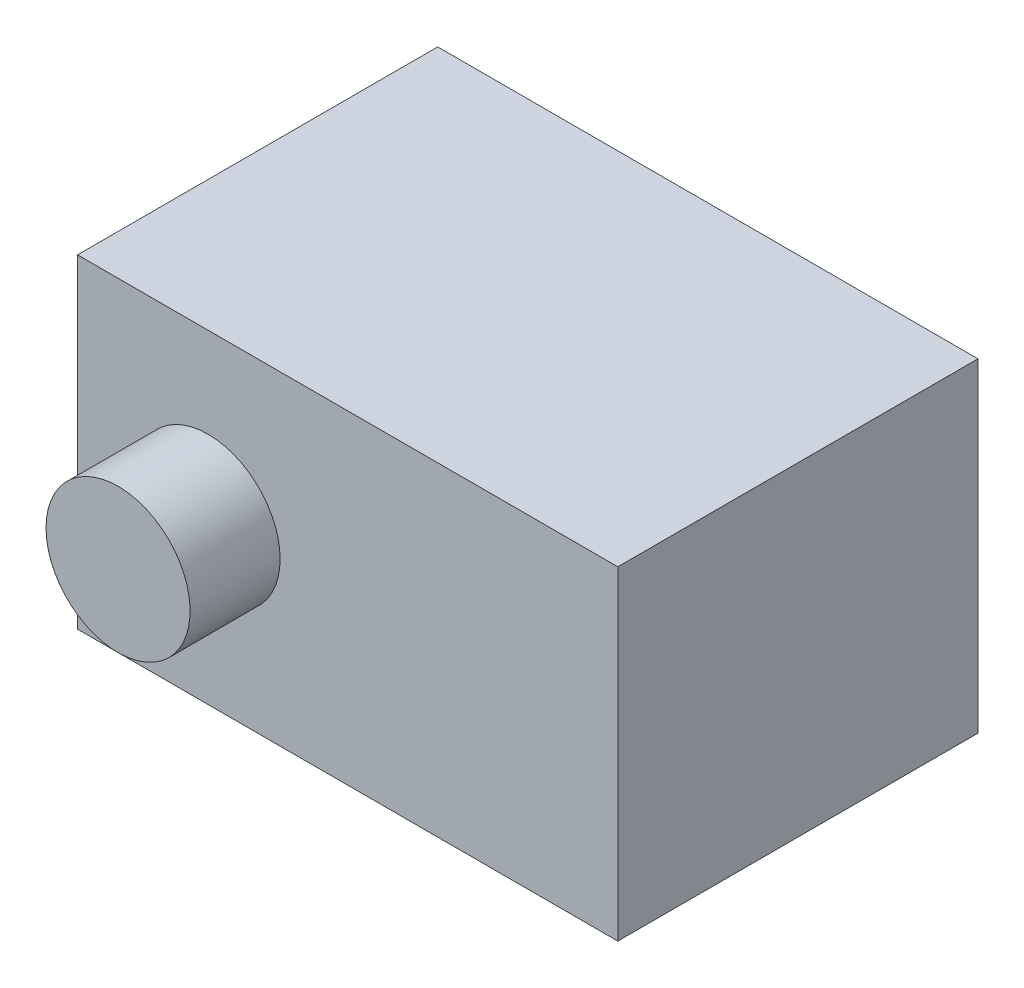
ISO-10303-21;
HEADER;
FILE_DESCRIPTION(('STEP AP214'),'2;1');
FILE_NAME('part.step','',(''),(''),'','','');
FILE_SCHEMA(('AUTOMOTIVE_DESIGN { 1 0 10303 214 1 1 1 1 }'));
ENDSEC;
DATA;
#1=APPLICATION_CONTEXT('core data for automotive mechanical design processes');
#2=APPLICATION_PROTOCOL_DEFINITION('international standard','automotive_design',2000,#1);
#3=PRODUCT_CONTEXT('',#1,'mechanical');
#4=PRODUCT('Part','Part','',(#3));
#5=PRODUCT_RELATED_PRODUCT_CATEGORY('part','',(#4));
#6=PRODUCT_DEFINITION_FORMATION('','',#4);
#7=PRODUCT_DEFINITION_CONTEXT('part definition',#1,'design');
#8=PRODUCT_DEFINITION('design','',#6,#7);
#9=PRODUCT_DEFINITION_SHAPE('','',#8);
#10=(LENGTH_UNIT() NAMED_UNIT(*) SI_UNIT(.MILLI.,.METRE.));
#11=(NAMED_UNIT(*) PLANE_ANGLE_UNIT() SI_UNIT($,.RADIAN.));
#12=(NAMED_UNIT(*) SI_UNIT($,.STERADIAN.) SOLID_ANGLE_UNIT());
#13=UNCERTAINTY_MEASURE_WITH_UNIT(LENGTH_MEASURE(1.E-05),#10,'distance_accuracy_value','');
#14=(GEOMETRIC_REPRESENTATION_CONTEXT(3) GLOBAL_UNCERTAINTY_ASSIGNED_CONTEXT((#13)) GLOBAL_UNIT_ASSIGNED_CONTEXT((#10,
#11,#12)) REPRESENTATION_CONTEXT('',''));
#15=CARTESIAN_POINT('',(0.,0.,0.));
#16=DIRECTION('',(0.,0.,1.));
#17=DIRECTION('',(1.,0.,0.));
#18=AXIS2_PLACEMENT_3D('',#15,#16,#17);
#19=CARTESIAN_POINT('',(15.,9.,20.));
#20=DIRECTION('',(-1.,0.,0.));
#21=DIRECTION('',(0.,-1.,0.));
#22=AXIS2_PLACEMENT_3D('',#19,#20,#21);
#23=PLANE('',#22);
#24=DIRECTION('',(0.,1.,0.));
#25=VECTOR('',#24,1.);
#26=CARTESIAN_POINT('',(15.,9.,0.));
#27=LINE('',#26,#25);
#28=CARTESIAN_POINT('',(15.,-9.,0.));
#29=VERTEX_POINT('',#28);
#30=CARTESIAN_POINT('',(15.,9.,0.));
#31=VERTEX_POINT('',#30);
#32=EDGE_CURVE('E99',#29,#31,#27,.T.);
#33=ORIENTED_EDGE('',*,*,#32,.T.);
#34=DIRECTION('',(0.,0.,-1.));
#35=VECTOR('',#34,1.);
#36=CARTESIAN_POINT('',(15.,9.,20.));
#37=LINE('',#36,#35);
#38=CARTESIAN_POINT('',(15.,9.,20.));
#39=VERTEX_POINT('',#38);
#40=EDGE_CURVE('E90',#39,#31,#37,.T.);
#41=ORIENTED_EDGE('',*,*,#40,.F.);
#42=DIRECTION('',(0.,1.,0.));
#43=VECTOR('',#42,1.);
#44=CARTESIAN_POINT('',(15.,9.,20.));
#45=LINE('',#44,#43);
#46=CARTESIAN_POINT('',(15.,-9.,20.));
#47=VERTEX_POINT('',#46);
#48=EDGE_CURVE('E84',#47,#39,#45,.T.);
#49=ORIENTED_EDGE('',*,*,#48,.F.);
#50=DIRECTION('',(0.,0.,-1.));
#51=VECTOR('',#50,1.);
#52=CARTESIAN_POINT('',(15.,-9.,20.));
#53=LINE('',#52,#51);
#54=EDGE_CURVE('E95',#47,#29,#53,.T.);
#55=ORIENTED_EDGE('',*,*,#54,.T.);
#56=EDGE_LOOP('',(#33,#41,#49,#55));
#57=FACE_BOUND('',#56,.T.);
#58=ADVANCED_FACE('F32',(#57),#23,.F.);
#59=CARTESIAN_POINT('',(-15.,9.,20.));
#60=DIRECTION('',(0.,-1.,0.));
#61=DIRECTION('',(0.,0.,-1.));
#62=AXIS2_PLACEMENT_3D('',#59,#60,#61);
#63=PLANE('',#62);
#64=DIRECTION('',(-1.,0.,0.));
#65=VECTOR('',#64,1.);
#66=CARTESIAN_POINT('',(-15.,9.,0.));
#67=LINE('',#66,#65);
#68=CARTESIAN_POINT('',(-15.,9.,0.));
#69=VERTEX_POINT('',#68);
#70=EDGE_CURVE('E89',#31,#69,#67,.T.);
#71=ORIENTED_EDGE('',*,*,#70,.T.);
#72=DIRECTION('',(0.,0.,-1.));
#73=VECTOR('',#72,1.);
#74=CARTESIAN_POINT('',(-15.,9.,20.));
#75=LINE('',#74,#73);
#76=CARTESIAN_POINT('',(-15.,9.,20.));
#77=VERTEX_POINT('',#76);
#78=EDGE_CURVE('E87',#77,#69,#75,.T.);
#79=ORIENTED_EDGE('',*,*,#78,.F.);
#80=DIRECTION('',(-1.,0.,0.));
#81=VECTOR('',#80,1.);
#82=CARTESIAN_POINT('',(-15.,9.,20.));
#83=LINE('',#82,#81);
#84=EDGE_CURVE('E79',#39,#77,#83,.T.);
#85=ORIENTED_EDGE('',*,*,#84,.F.);
#86=ORIENTED_EDGE('',*,*,#40,.T.);
#87=EDGE_LOOP('',(#71,#79,#85,#86));
#88=FACE_BOUND('',#87,.T.);
#89=ADVANCED_FACE('F88',(#88),#63,.F.);
#90=CARTESIAN_POINT('',(-15.,9.,20.));
#91=DIRECTION('',(1.,0.,0.));
#92=DIRECTION('',(0.,1.,0.));
#93=AXIS2_PLACEMENT_3D('',#90,#91,#92);
#94=PLANE('',#93);
#95=DIRECTION('',(0.,-1.,0.));
#96=VECTOR('',#95,1.);
#97=CARTESIAN_POINT('',(-15.,9.,0.));
#98=LINE('',#97,#96);
#99=CARTESIAN_POINT('',(-15.,-9.,0.));
#100=VERTEX_POINT('',#99);
#101=EDGE_CURVE('E65',#69,#100,#98,.T.);
#102=ORIENTED_EDGE('',*,*,#101,.T.);
#103=DIRECTION('',(0.,0.,-1.));
#104=VECTOR('',#103,1.);
#105=CARTESIAN_POINT('',(-15.,-9.,20.));
#106=LINE('',#105,#104);
#107=CARTESIAN_POINT('',(-15.,-9.,20.));
#108=VERTEX_POINT('',#107);
#109=EDGE_CURVE('E91',#108,#100,#106,.T.);
#110=ORIENTED_EDGE('',*,*,#109,.F.);
#111=DIRECTION('',(0.,-1.,0.));
#112=VECTOR('',#111,1.);
#113=CARTESIAN_POINT('',(-15.,9.,20.));
#114=LINE('',#113,#112);
#115=EDGE_CURVE('E82',#77,#108,#114,.T.);
#116=ORIENTED_EDGE('',*,*,#115,.F.);
#117=ORIENTED_EDGE('',*,*,#78,.T.);
#118=EDGE_LOOP('',(#102,#110,#116,#117));
#119=FACE_BOUND('',#118,.T.);
#120=ADVANCED_FACE('F93',(#119),#94,.F.);
#121=CARTESIAN_POINT('',(-15.,-9.,20.));
#122=DIRECTION('',(0.,1.,0.));
#123=DIRECTION('',(0.,0.,1.));
#124=AXIS2_PLACEMENT_3D('',#121,#122,#123);
#125=PLANE('',#124);
#126=DIRECTION('',(1.,0.,0.));
#127=VECTOR('',#126,1.);
#128=CARTESIAN_POINT('',(-15.,-9.,0.));
#129=LINE('',#128,#127);
#130=EDGE_CURVE('E71',#100,#29,#129,.T.);
#131=ORIENTED_EDGE('',*,*,#130,.T.);
#132=ORIENTED_EDGE('',*,*,#54,.F.);
#133=DIRECTION('',(1.,0.,0.));
#134=VECTOR('',#133,1.);
#135=CARTESIAN_POINT('',(-15.,-9.,20.));
#136=LINE('',#135,#134);
#137=EDGE_CURVE('E48',#108,#47,#136,.T.);
#138=ORIENTED_EDGE('',*,*,#137,.F.);
#139=ORIENTED_EDGE('',*,*,#109,.T.);
#140=EDGE_LOOP('',(#131,#132,#138,#139));
#141=FACE_BOUND('',#140,.T.);
#142=ADVANCED_FACE('F119',(#141),#125,.F.);
#143=CARTESIAN_POINT('',(0.,0.,20.));
#144=DIRECTION('',(0.,0.,1.));
#145=DIRECTION('',(1.,0.,0.));
#146=AXIS2_PLACEMENT_3D('',#143,#144,#145);
#147=PLANE('',#146);
#148=CARTESIAN_POINT('',(-7.75,0.,20.));
#149=DIRECTION('',(0.,0.,1.));
#150=DIRECTION('',(1.,0.,0.));
#151=AXIS2_PLACEMENT_3D('',#148,#149,#150);
#152=CIRCLE('',#151,4.);
#153=CARTESIAN_POINT('',(-3.75,0.,20.));
#154=VERTEX_POINT('',#153);
#155=EDGE_CURVE('E11',#154,#154,#152,.T.);
#156=ORIENTED_EDGE('',*,*,#155,.F.);
#157=EDGE_LOOP('',(#156));
#158=FACE_BOUND('',#157,.T.);
#159=ORIENTED_EDGE('',*,*,#48,.T.);
#160=ORIENTED_EDGE('',*,*,#84,.T.);
#161=ORIENTED_EDGE('',*,*,#115,.T.);
#162=ORIENTED_EDGE('',*,*,#137,.T.);
#163=EDGE_LOOP('',(#159,#160,#161,#162));
#164=FACE_BOUND('',#163,.T.);
#165=ADVANCED_FACE('F80',(#158,#164),#147,.T.);
#166=CARTESIAN_POINT('',(0.,0.,0.));
#167=DIRECTION('',(0.,0.,1.));
#168=DIRECTION('',(1.,0.,0.));
#169=AXIS2_PLACEMENT_3D('',#166,#167,#168);
#170=PLANE('',#169);
#171=CARTESIAN_POINT('',(-7.75,0.,0.));
#172=DIRECTION('',(0.,0.,1.));
#173=DIRECTION('',(1.,0.,0.));
#174=AXIS2_PLACEMENT_3D('',#171,#172,#173);
#175=CIRCLE('',#174,4.);
#176=CARTESIAN_POINT('',(-3.75,0.,0.));
#177=VERTEX_POINT('',#176);
#178=EDGE_CURVE('E40',#177,#177,#175,.F.);
#179=ORIENTED_EDGE('',*,*,#178,.F.);
#180=EDGE_LOOP('',(#179));
#181=FACE_BOUND('',#180,.T.);
#182=ORIENTED_EDGE('',*,*,#32,.F.);
#183=ORIENTED_EDGE('',*,*,#130,.F.);
#184=ORIENTED_EDGE('',*,*,#101,.F.);
#185=ORIENTED_EDGE('',*,*,#70,.F.);
#186=EDGE_LOOP('',(#182,#183,#184,#185));
#187=FACE_BOUND('',#186,.T.);
#188=ADVANCED_FACE('F113',(#181,#187),#170,.F.);
#189=CARTESIAN_POINT('',(-7.75,0.,-5.));
#190=DIRECTION('',(0.,0.,1.));
#191=DIRECTION('',(1.,0.,0.));
#192=AXIS2_PLACEMENT_3D('',#189,#190,#191);
#193=CYLINDRICAL_SURFACE('',#192,4.);
#194=CARTESIAN_POINT('',(-7.75,0.,-5.));
#195=DIRECTION('',(0.,0.,-1.));
#196=DIRECTION('',(-1.,0.,0.));
#197=AXIS2_PLACEMENT_3D('',#194,#195,#196);
#198=CIRCLE('',#197,4.);
#199=CARTESIAN_POINT('',(-11.75,0.,-5.));
#200=VERTEX_POINT('',#199);
#201=EDGE_CURVE('E102',#200,#200,#198,.T.);
#202=ORIENTED_EDGE('',*,*,#201,.F.);
#203=EDGE_LOOP('',(#202));
#204=FACE_BOUND('',#203,.T.);
#205=ORIENTED_EDGE('',*,*,#178,.T.);
#206=EDGE_LOOP('',(#205));
#207=FACE_BOUND('',#206,.T.);
#208=ADVANCED_FACE('F111',(#204,#207),#193,.T.);
#209=CARTESIAN_POINT('',(-7.75,0.,-5.));
#210=DIRECTION('',(0.,0.,-1.));
#211=DIRECTION('',(-1.,0.,0.));
#212=AXIS2_PLACEMENT_3D('',#209,#210,#211);
#213=PLANE('',#212);
#214=ORIENTED_EDGE('',*,*,#201,.T.);
#215=EDGE_LOOP('',(#214));
#216=FACE_BOUND('',#215,.T.);
#217=ADVANCED_FACE('F159',(#216),#213,.T.);
#218=CARTESIAN_POINT('',(-7.75,0.,25.));
#219=DIRECTION('',(0.,0.,-1.));
#220=DIRECTION('',(-1.,0.,0.));
#221=AXIS2_PLACEMENT_3D('',#218,#219,#220);
#222=CYLINDRICAL_SURFACE('',#221,4.);
#223=CARTESIAN_POINT('',(-7.75,0.,25.));
#224=DIRECTION('',(0.,0.,-1.));
#225=DIRECTION('',(-1.,0.,0.));
#226=AXIS2_PLACEMENT_3D('',#223,#224,#225);
#227=CIRCLE('',#226,4.);
#228=CARTESIAN_POINT('',(-11.75,0.,25.));
#229=VERTEX_POINT('',#228);
#230=EDGE_CURVE('E200',#229,#229,#227,.T.);
#231=ORIENTED_EDGE('',*,*,#230,.T.);
#232=EDGE_LOOP('',(#231));
#233=FACE_BOUND('',#232,.T.);
#234=ORIENTED_EDGE('',*,*,#155,.T.);
#235=EDGE_LOOP('',(#234));
#236=FACE_BOUND('',#235,.T.);
#237=ADVANCED_FACE('F169',(#233,#236),#222,.T.);
#238=CARTESIAN_POINT('',(-7.75,0.,25.));
#239=DIRECTION('',(0.,0.,1.));
#240=DIRECTION('',(-1.,0.,0.));
#241=AXIS2_PLACEMENT_3D('',#238,#239,#240);
#242=PLANE('',#241);
#243=ORIENTED_EDGE('',*,*,#230,.F.);
#244=EDGE_LOOP('',(#243));
#245=FACE_BOUND('',#244,.T.);
#246=ADVANCED_FACE('F184',(#245),#242,.T.);
#247=CLOSED_SHELL('',(#58,#89,#120,#142,#165,#188,#208,#217,#237,#246));
#248=MANIFOLD_SOLID_BREP('B2',#247);
#249=ADVANCED_BREP_SHAPE_REPRESENTATION('',(#18,#248),#14);
#250=SHAPE_DEFINITION_REPRESENTATION(#9,#249);
ENDSEC;
END-ISO-10303-21;
